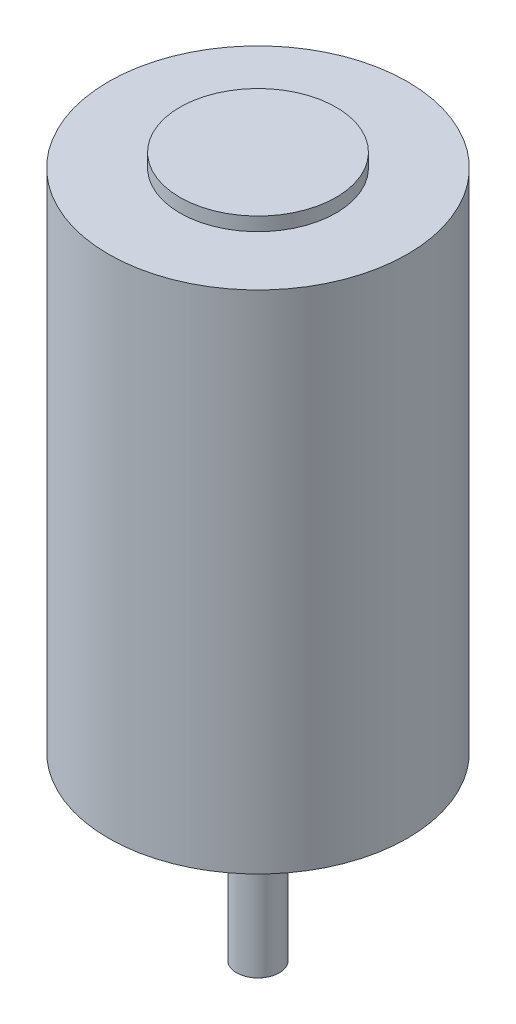
ISO-10303-21;
HEADER;
FILE_DESCRIPTION(('STEP AP214'),'2;1');
FILE_NAME('part.step','',(''),(''),'','','');
FILE_SCHEMA(('AUTOMOTIVE_DESIGN { 1 0 10303 214 1 1 1 1 }'));
ENDSEC;
DATA;
#1=APPLICATION_CONTEXT('core data for automotive mechanical design processes');
#2=APPLICATION_PROTOCOL_DEFINITION('international standard','automotive_design',2000,#1);
#3=PRODUCT_CONTEXT('',#1,'mechanical');
#4=PRODUCT('Part','Part','',(#3));
#5=PRODUCT_RELATED_PRODUCT_CATEGORY('part','',(#4));
#6=PRODUCT_DEFINITION_FORMATION('','',#4);
#7=PRODUCT_DEFINITION_CONTEXT('part definition',#1,'design');
#8=PRODUCT_DEFINITION('design','',#6,#7);
#9=PRODUCT_DEFINITION_SHAPE('','',#8);
#10=(LENGTH_UNIT() NAMED_UNIT(*) SI_UNIT(.MILLI.,.METRE.));
#11=(NAMED_UNIT(*) PLANE_ANGLE_UNIT() SI_UNIT($,.RADIAN.));
#12=(NAMED_UNIT(*) SI_UNIT($,.STERADIAN.) SOLID_ANGLE_UNIT());
#13=UNCERTAINTY_MEASURE_WITH_UNIT(LENGTH_MEASURE(1.E-05),#10,'distance_accuracy_value','');
#14=(GEOMETRIC_REPRESENTATION_CONTEXT(3) GLOBAL_UNCERTAINTY_ASSIGNED_CONTEXT((#13)) GLOBAL_UNIT_ASSIGNED_CONTEXT((#10,
#11,#12)) REPRESENTATION_CONTEXT('',''));
#15=CARTESIAN_POINT('',(0.,0.,0.));
#16=DIRECTION('',(0.,0.,1.));
#17=DIRECTION('',(1.,0.,0.));
#18=AXIS2_PLACEMENT_3D('',#15,#16,#17);
#19=CARTESIAN_POINT('',(0.,71.12,0.));
#20=DIRECTION('',(0.,-1.,0.));
#21=DIRECTION('',(0.,0.,-1.));
#22=AXIS2_PLACEMENT_3D('',#19,#20,#21);
#23=CYLINDRICAL_SURFACE('',#22,21.0185);
#24=CARTESIAN_POINT('',(0.,71.12,0.));
#25=DIRECTION('',(0.,1.,0.));
#26=DIRECTION('',(0.,0.,1.));
#27=AXIS2_PLACEMENT_3D('',#24,#25,#26);
#28=CIRCLE('',#27,21.0185);
#29=CARTESIAN_POINT('',(0.,71.12,21.0185));
#30=VERTEX_POINT('',#29);
#31=EDGE_CURVE('E56',#30,#30,#28,.T.);
#32=ORIENTED_EDGE('',*,*,#31,.F.);
#33=EDGE_LOOP('',(#32));
#34=FACE_BOUND('',#33,.T.);
#35=CARTESIAN_POINT('',(0.,0.,0.));
#36=DIRECTION('',(0.,1.,0.));
#37=DIRECTION('',(0.,0.,1.));
#38=AXIS2_PLACEMENT_3D('',#35,#36,#37);
#39=CIRCLE('',#38,21.0185);
#40=CARTESIAN_POINT('',(0.,0.,21.0185));
#41=VERTEX_POINT('',#40);
#42=EDGE_CURVE('E59',#41,#41,#39,.T.);
#43=ORIENTED_EDGE('',*,*,#42,.T.);
#44=EDGE_LOOP('',(#43));
#45=FACE_BOUND('',#44,.T.);
#46=ADVANCED_FACE('F41',(#34,#45),#23,.T.);
#47=CARTESIAN_POINT('',(0.,71.12,0.));
#48=DIRECTION('',(0.,1.,0.));
#49=DIRECTION('',(0.,0.,1.));
#50=AXIS2_PLACEMENT_3D('',#47,#48,#49);
#51=PLANE('',#50);
#52=CARTESIAN_POINT('',(0.,71.12,0.));
#53=DIRECTION('',(0.,1.,0.));
#54=DIRECTION('',(0.,0.,1.));
#55=AXIS2_PLACEMENT_3D('',#52,#53,#54);
#56=CIRCLE('',#55,10.9855);
#57=CARTESIAN_POINT('',(0.,71.12,10.9855));
#58=VERTEX_POINT('',#57);
#59=EDGE_CURVE('E51',#58,#58,#56,.T.);
#60=ORIENTED_EDGE('',*,*,#59,.F.);
#61=EDGE_LOOP('',(#60));
#62=FACE_BOUND('',#61,.T.);
#63=ORIENTED_EDGE('',*,*,#31,.T.);
#64=EDGE_LOOP('',(#63));
#65=FACE_BOUND('',#64,.T.);
#66=ADVANCED_FACE('F102',(#62,#65),#51,.T.);
#67=CARTESIAN_POINT('',(0.,0.,0.));
#68=DIRECTION('',(0.,1.,0.));
#69=DIRECTION('',(0.,0.,1.));
#70=AXIS2_PLACEMENT_3D('',#67,#68,#69);
#71=PLANE('',#70);
#72=CARTESIAN_POINT('',(16.,0.,0.));
#73=DIRECTION('',(0.,-1.,0.));
#74=DIRECTION('',(0.,0.,-1.));
#75=AXIS2_PLACEMENT_3D('',#72,#73,#74);
#76=CIRCLE('',#75,1.27);
#77=CARTESIAN_POINT('',(16.,0.,-1.27));
#78=VERTEX_POINT('',#77);
#79=EDGE_CURVE('E76',#78,#78,#76,.T.);
#80=ORIENTED_EDGE('',*,*,#79,.F.);
#81=EDGE_LOOP('',(#80));
#82=FACE_BOUND('',#81,.T.);
#83=CARTESIAN_POINT('',(-16.,0.,0.));
#84=DIRECTION('',(0.,-1.,0.));
#85=DIRECTION('',(0.,0.,1.));
#86=AXIS2_PLACEMENT_3D('',#83,#84,#85);
#87=CIRCLE('',#86,1.27);
#88=CARTESIAN_POINT('',(-16.,0.,1.27));
#89=VERTEX_POINT('',#88);
#90=EDGE_CURVE('E257',#89,#89,#87,.T.);
#91=ORIENTED_EDGE('',*,*,#90,.F.);
#92=EDGE_LOOP('',(#91));
#93=FACE_BOUND('',#92,.T.);
#94=CARTESIAN_POINT('',(0.,0.,0.));
#95=DIRECTION('',(0.,1.,0.));
#96=DIRECTION('',(0.,0.,1.));
#97=AXIS2_PLACEMENT_3D('',#94,#95,#96);
#98=CIRCLE('',#97,10.9855);
#99=CARTESIAN_POINT('',(0.,0.,10.9855));
#100=VERTEX_POINT('',#99);
#101=EDGE_CURVE('E47',#100,#100,#98,.F.);
#102=ORIENTED_EDGE('',*,*,#101,.F.);
#103=EDGE_LOOP('',(#102));
#104=FACE_BOUND('',#103,.T.);
#105=ORIENTED_EDGE('',*,*,#42,.F.);
#106=EDGE_LOOP('',(#105));
#107=FACE_BOUND('',#106,.T.);
#108=ADVANCED_FACE('F99',(#82,#93,#104,#107),#71,.F.);
#109=CARTESIAN_POINT('',(0.,73.025,0.));
#110=DIRECTION('',(0.,-1.,0.));
#111=DIRECTION('',(0.,0.,-1.));
#112=AXIS2_PLACEMENT_3D('',#109,#110,#111);
#113=CYLINDRICAL_SURFACE('',#112,10.9855);
#114=CARTESIAN_POINT('',(0.,73.025,0.));
#115=DIRECTION('',(0.,1.,0.));
#116=DIRECTION('',(0.,0.,1.));
#117=AXIS2_PLACEMENT_3D('',#114,#115,#116);
#118=CIRCLE('',#117,10.9855);
#119=CARTESIAN_POINT('',(0.,73.025,10.9855));
#120=VERTEX_POINT('',#119);
#121=EDGE_CURVE('E90',#120,#120,#118,.T.);
#122=ORIENTED_EDGE('',*,*,#121,.F.);
#123=EDGE_LOOP('',(#122));
#124=FACE_BOUND('',#123,.T.);
#125=ORIENTED_EDGE('',*,*,#59,.T.);
#126=EDGE_LOOP('',(#125));
#127=FACE_BOUND('',#126,.T.);
#128=ADVANCED_FACE('F101',(#124,#127),#113,.T.);
#129=CARTESIAN_POINT('',(0.,73.025,0.));
#130=DIRECTION('',(0.,1.,0.));
#131=DIRECTION('',(0.,0.,1.));
#132=AXIS2_PLACEMENT_3D('',#129,#130,#131);
#133=PLANE('',#132);
#134=ORIENTED_EDGE('',*,*,#121,.T.);
#135=EDGE_LOOP('',(#134));
#136=FACE_BOUND('',#135,.T.);
#137=ADVANCED_FACE('F110',(#136),#133,.T.);
#138=CARTESIAN_POINT('',(0.,-1.905,0.));
#139=DIRECTION('',(0.,-1.,0.));
#140=DIRECTION('',(0.,0.,-1.));
#141=AXIS2_PLACEMENT_3D('',#138,#139,#140);
#142=PLANE('',#141);
#143=CARTESIAN_POINT('',(0.,-1.905,0.));
#144=DIRECTION('',(0.,-1.,0.));
#145=DIRECTION('',(0.,0.,-1.));
#146=AXIS2_PLACEMENT_3D('',#143,#144,#145);
#147=CIRCLE('',#146,10.9855);
#148=CARTESIAN_POINT('',(0.,-1.905,-10.9855));
#149=VERTEX_POINT('',#148);
#150=EDGE_CURVE('E85',#149,#149,#147,.T.);
#151=ORIENTED_EDGE('',*,*,#150,.T.);
#152=EDGE_LOOP('',(#151));
#153=FACE_BOUND('',#152,.T.);
#154=CARTESIAN_POINT('',(0.,-1.905,0.));
#155=DIRECTION('',(0.,-1.,0.));
#156=DIRECTION('',(0.,0.,-1.));
#157=AXIS2_PLACEMENT_3D('',#154,#155,#156);
#158=CIRCLE('',#157,8.4455);
#159=CARTESIAN_POINT('',(0.,-1.905,-8.4455));
#160=VERTEX_POINT('',#159);
#161=EDGE_CURVE('E82',#160,#160,#158,.T.);
#162=ORIENTED_EDGE('',*,*,#161,.F.);
#163=EDGE_LOOP('',(#162));
#164=FACE_BOUND('',#163,.T.);
#165=ADVANCED_FACE('F143',(#153,#164),#142,.T.);
#166=CARTESIAN_POINT('',(0.,-1.905,0.));
#167=DIRECTION('',(0.,1.,0.));
#168=DIRECTION('',(0.,0.,1.));
#169=AXIS2_PLACEMENT_3D('',#166,#167,#168);
#170=CYLINDRICAL_SURFACE('',#169,10.9855);
#171=ORIENTED_EDGE('',*,*,#150,.F.);
#172=EDGE_LOOP('',(#171));
#173=FACE_BOUND('',#172,.T.);
#174=ORIENTED_EDGE('',*,*,#101,.T.);
#175=EDGE_LOOP('',(#174));
#176=FACE_BOUND('',#175,.T.);
#177=ADVANCED_FACE('F153',(#173,#176),#170,.T.);
#178=CARTESIAN_POINT('',(0.,-1.905,0.));
#179=DIRECTION('',(0.,1.,0.));
#180=DIRECTION('',(0.,0.,1.));
#181=AXIS2_PLACEMENT_3D('',#178,#179,#180);
#182=CYLINDRICAL_SURFACE('',#181,8.4455);
#183=ORIENTED_EDGE('',*,*,#161,.T.);
#184=EDGE_LOOP('',(#183));
#185=FACE_BOUND('',#184,.T.);
#186=CARTESIAN_POINT('',(0.,0.,0.));
#187=DIRECTION('',(0.,-1.,0.));
#188=DIRECTION('',(0.,0.,-1.));
#189=AXIS2_PLACEMENT_3D('',#186,#187,#188);
#190=CIRCLE('',#189,8.4455);
#191=CARTESIAN_POINT('',(0.,0.,-8.4455));
#192=VERTEX_POINT('',#191);
#193=EDGE_CURVE('E68',#192,#192,#190,.T.);
#194=ORIENTED_EDGE('',*,*,#193,.F.);
#195=EDGE_LOOP('',(#194));
#196=FACE_BOUND('',#195,.T.);
#197=ADVANCED_FACE('F120',(#185,#196),#182,.F.);
#198=CARTESIAN_POINT('',(0.,0.,0.));
#199=DIRECTION('',(0.,1.,0.));
#200=DIRECTION('',(0.,0.,1.));
#201=AXIS2_PLACEMENT_3D('',#198,#199,#200);
#202=CIRCLE('',#201,5.08);
#203=CARTESIAN_POINT('',(0.,0.,5.08));
#204=VERTEX_POINT('',#203);
#205=EDGE_CURVE('E10',#204,#204,#202,.F.);
#206=ORIENTED_EDGE('',*,*,#205,.F.);
#207=EDGE_LOOP('',(#206));
#208=FACE_BOUND('',#207,.T.);
#209=ORIENTED_EDGE('',*,*,#193,.T.);
#210=EDGE_LOOP('',(#209));
#211=FACE_BOUND('',#210,.T.);
#212=ADVANCED_FACE('F104',(#208,#211),#71,.F.);
#213=CARTESIAN_POINT('',(0.,-3.429,0.));
#214=DIRECTION('',(0.,1.,0.));
#215=DIRECTION('',(0.,0.,1.));
#216=AXIS2_PLACEMENT_3D('',#213,#214,#215);
#217=CYLINDRICAL_SURFACE('',#216,5.08);
#218=CARTESIAN_POINT('',(0.,-3.429,0.));
#219=DIRECTION('',(0.,-1.,0.));
#220=DIRECTION('',(0.,0.,-1.));
#221=AXIS2_PLACEMENT_3D('',#218,#219,#220);
#222=CIRCLE('',#221,5.08);
#223=CARTESIAN_POINT('',(0.,-3.429,-5.08));
#224=VERTEX_POINT('',#223);
#225=EDGE_CURVE('E64',#224,#224,#222,.T.);
#226=ORIENTED_EDGE('',*,*,#225,.F.);
#227=EDGE_LOOP('',(#226));
#228=FACE_BOUND('',#227,.T.);
#229=ORIENTED_EDGE('',*,*,#205,.T.);
#230=EDGE_LOOP('',(#229));
#231=FACE_BOUND('',#230,.T.);
#232=ADVANCED_FACE('F119',(#228,#231),#217,.T.);
#233=CARTESIAN_POINT('',(0.,-3.429,0.));
#234=DIRECTION('',(0.,-1.,0.));
#235=DIRECTION('',(0.,0.,-1.));
#236=AXIS2_PLACEMENT_3D('',#233,#234,#235);
#237=PLANE('',#236);
#238=CARTESIAN_POINT('',(0.,-3.429,0.));
#239=DIRECTION('',(0.,-1.,0.));
#240=DIRECTION('',(0.,0.,-1.));
#241=AXIS2_PLACEMENT_3D('',#238,#239,#240);
#242=CIRCLE('',#241,3.);
#243=CARTESIAN_POINT('',(0.,-3.429,-3.));
#244=VERTEX_POINT('',#243);
#245=EDGE_CURVE('E61',#244,#244,#242,.T.);
#246=ORIENTED_EDGE('',*,*,#245,.F.);
#247=EDGE_LOOP('',(#246));
#248=FACE_BOUND('',#247,.T.);
#249=ORIENTED_EDGE('',*,*,#225,.T.);
#250=EDGE_LOOP('',(#249));
#251=FACE_BOUND('',#250,.T.);
#252=ADVANCED_FACE('F180',(#248,#251),#237,.T.);
#253=CARTESIAN_POINT('',(0.,-25.4,0.));
#254=DIRECTION('',(0.,-1.,0.));
#255=DIRECTION('',(0.,0.,-1.));
#256=AXIS2_PLACEMENT_3D('',#253,#254,#255);
#257=PLANE('',#256);
#258=CARTESIAN_POINT('',(0.,-25.4,0.));
#259=DIRECTION('',(0.,-1.,0.));
#260=DIRECTION('',(0.,0.,-1.));
#261=AXIS2_PLACEMENT_3D('',#258,#259,#260);
#262=CIRCLE('',#261,3.);
#263=CARTESIAN_POINT('',(0.,-25.4,-3.));
#264=VERTEX_POINT('',#263);
#265=EDGE_CURVE('E63',#264,#264,#262,.T.);
#266=ORIENTED_EDGE('',*,*,#265,.T.);
#267=EDGE_LOOP('',(#266));
#268=FACE_BOUND('',#267,.T.);
#269=ADVANCED_FACE('F176',(#268),#257,.T.);
#270=CARTESIAN_POINT('',(0.,-25.4,0.));
#271=DIRECTION('',(0.,1.,0.));
#272=DIRECTION('',(0.,0.,1.));
#273=AXIS2_PLACEMENT_3D('',#270,#271,#272);
#274=CYLINDRICAL_SURFACE('',#273,3.);
#275=ORIENTED_EDGE('',*,*,#245,.T.);
#276=EDGE_LOOP('',(#275));
#277=FACE_BOUND('',#276,.T.);
#278=ORIENTED_EDGE('',*,*,#265,.F.);
#279=EDGE_LOOP('',(#278));
#280=FACE_BOUND('',#279,.T.);
#281=ADVANCED_FACE('F179',(#277,#280),#274,.T.);
#282=CARTESIAN_POINT('',(-16.,5.08,0.));
#283=DIRECTION('',(0.,-1.,0.));
#284=DIRECTION('',(0.,0.,-1.));
#285=AXIS2_PLACEMENT_3D('',#282,#283,#284);
#286=CYLINDRICAL_SURFACE('',#285,1.27);
#287=CARTESIAN_POINT('',(-16.,5.08,0.));
#288=DIRECTION('',(0.,-1.,0.));
#289=DIRECTION('',(0.,0.,1.));
#290=AXIS2_PLACEMENT_3D('',#287,#288,#289);
#291=CIRCLE('',#290,1.27);
#292=CARTESIAN_POINT('',(-16.,5.08,1.27));
#293=VERTEX_POINT('',#292);
#294=EDGE_CURVE('E79',#293,#293,#291,.T.);
#295=ORIENTED_EDGE('',*,*,#294,.F.);
#296=EDGE_LOOP('',(#295));
#297=FACE_BOUND('',#296,.T.);
#298=ORIENTED_EDGE('',*,*,#90,.T.);
#299=EDGE_LOOP('',(#298));
#300=FACE_BOUND('',#299,.T.);
#301=ADVANCED_FACE('F207',(#297,#300),#286,.F.);
#302=CARTESIAN_POINT('',(-16.,5.08,0.));
#303=DIRECTION('',(0.,1.,0.));
#304=DIRECTION('',(0.,0.,1.));
#305=AXIS2_PLACEMENT_3D('',#302,#303,#304);
#306=PLANE('',#305);
#307=ORIENTED_EDGE('',*,*,#294,.T.);
#308=EDGE_LOOP('',(#307));
#309=FACE_BOUND('',#308,.T.);
#310=ADVANCED_FACE('F220',(#309),#306,.F.);
#311=CARTESIAN_POINT('',(16.,5.08,0.));
#312=DIRECTION('',(0.,-1.,0.));
#313=DIRECTION('',(0.,0.,-1.));
#314=AXIS2_PLACEMENT_3D('',#311,#312,#313);
#315=CYLINDRICAL_SURFACE('',#314,1.27);
#316=CARTESIAN_POINT('',(16.,5.08,0.));
#317=DIRECTION('',(0.,-1.,0.));
#318=DIRECTION('',(0.,0.,-1.));
#319=AXIS2_PLACEMENT_3D('',#316,#317,#318);
#320=CIRCLE('',#319,1.27);
#321=CARTESIAN_POINT('',(16.,5.08,-1.27));
#322=VERTEX_POINT('',#321);
#323=EDGE_CURVE('E71',#322,#322,#320,.T.);
#324=ORIENTED_EDGE('',*,*,#323,.F.);
#325=EDGE_LOOP('',(#324));
#326=FACE_BOUND('',#325,.T.);
#327=ORIENTED_EDGE('',*,*,#79,.T.);
#328=EDGE_LOOP('',(#327));
#329=FACE_BOUND('',#328,.T.);
#330=ADVANCED_FACE('F229',(#326,#329),#315,.F.);
#331=CARTESIAN_POINT('',(16.,5.08,0.));
#332=DIRECTION('',(0.,-1.,0.));
#333=DIRECTION('',(0.,0.,-1.));
#334=AXIS2_PLACEMENT_3D('',#331,#332,#333);
#335=PLANE('',#334);
#336=ORIENTED_EDGE('',*,*,#323,.T.);
#337=EDGE_LOOP('',(#336));
#338=FACE_BOUND('',#337,.T.);
#339=ADVANCED_FACE('F238',(#338),#335,.T.);
#340=CLOSED_SHELL('',(#46,#66,#108,#128,#137,#165,#177,#197,#212,#232,#252,#269,#281,#301,#310,
#330,#339));
#341=MANIFOLD_SOLID_BREP('B2',#340);
#342=ADVANCED_BREP_SHAPE_REPRESENTATION('',(#18,#341),#14);
#343=SHAPE_DEFINITION_REPRESENTATION(#9,#342);
ENDSEC;
END-ISO-10303-21;
